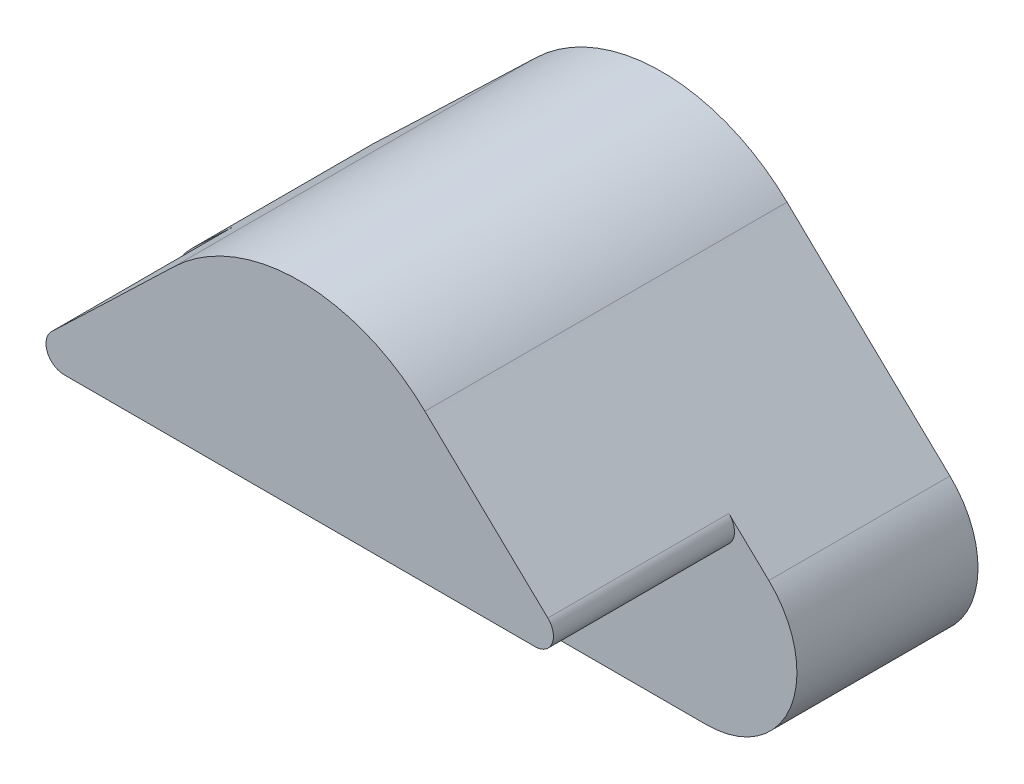
ISO-10303-21;
HEADER;
FILE_DESCRIPTION(('STEP AP214'),'2;1');
FILE_NAME('part.step','',(''),(''),'','','');
FILE_SCHEMA(('AUTOMOTIVE_DESIGN { 1 0 10303 214 1 1 1 1 }'));
ENDSEC;
DATA;
#1=APPLICATION_CONTEXT('core data for automotive mechanical design processes');
#2=APPLICATION_PROTOCOL_DEFINITION('international standard','automotive_design',2000,#1);
#3=PRODUCT_CONTEXT('',#1,'mechanical');
#4=PRODUCT('Part','Part','',(#3));
#5=PRODUCT_RELATED_PRODUCT_CATEGORY('part','',(#4));
#6=PRODUCT_DEFINITION_FORMATION('','',#4);
#7=PRODUCT_DEFINITION_CONTEXT('part definition',#1,'design');
#8=PRODUCT_DEFINITION('design','',#6,#7);
#9=PRODUCT_DEFINITION_SHAPE('','',#8);
#10=(LENGTH_UNIT() NAMED_UNIT(*) SI_UNIT(.MILLI.,.METRE.));
#11=(NAMED_UNIT(*) PLANE_ANGLE_UNIT() SI_UNIT($,.RADIAN.));
#12=(NAMED_UNIT(*) SI_UNIT($,.STERADIAN.) SOLID_ANGLE_UNIT());
#13=UNCERTAINTY_MEASURE_WITH_UNIT(LENGTH_MEASURE(1.E-05),#10,'distance_accuracy_value','');
#14=(GEOMETRIC_REPRESENTATION_CONTEXT(3) GLOBAL_UNCERTAINTY_ASSIGNED_CONTEXT((#13)) GLOBAL_UNIT_ASSIGNED_CONTEXT((#10,
#11,#12)) REPRESENTATION_CONTEXT('',''));
#15=CARTESIAN_POINT('',(0.,0.,0.));
#16=DIRECTION('',(0.,0.,1.));
#17=DIRECTION('',(1.,0.,0.));
#18=AXIS2_PLACEMENT_3D('',#15,#16,#17);
#19=CARTESIAN_POINT('',(-308.287195738068,327.322533480247,4.));
#20=DIRECTION('',(0.,0.,1.));
#21=DIRECTION('',(1.,0.,0.));
#22=AXIS2_PLACEMENT_3D('',#19,#20,#21);
#23=PLANE('',#22);
#24=CARTESIAN_POINT('',(-308.287195738068,327.322533480247,4.));
#25=DIRECTION('',(0.,0.,-1.));
#26=DIRECTION('',(1.,0.,0.));
#27=AXIS2_PLACEMENT_3D('',#24,#25,#26);
#28=CIRCLE('',#27,449.645455864917);
#29=CARTESIAN_POINT('',(3.61268527483216,3.44061023644068,4.));
#30=VERTEX_POINT('',#29);
#31=CARTESIAN_POINT('',(2.26130598674446,2.14463746570681,4.));
#32=VERTEX_POINT('',#31);
#33=EDGE_CURVE('E204',#30,#32,#28,.T.);
#34=ORIENTED_EDGE('',*,*,#33,.T.);
#35=CARTESIAN_POINT('',(2.3994363726626,2.,4.));
#36=DIRECTION('',(0.,0.,1.));
#37=DIRECTION('',(1.,0.,0.));
#38=AXIS2_PLACEMENT_3D('',#35,#36,#37);
#39=CIRCLE('',#38,0.2);
#40=CARTESIAN_POINT('',(2.3994363726626,1.8,4.));
#41=VERTEX_POINT('',#40);
#42=EDGE_CURVE('E248',#32,#41,#39,.T.);
#43=ORIENTED_EDGE('',*,*,#42,.T.);
#44=DIRECTION('',(-1.,0.,0.));
#45=VECTOR('',#44,1.);
#46=CARTESIAN_POINT('',(0.99783252754089,1.8,4.));
#47=LINE('',#46,#45);
#48=CARTESIAN_POINT('',(3.,1.8,4.));
#49=VERTEX_POINT('',#48);
#50=EDGE_CURVE('E155',#49,#41,#47,.T.);
#51=ORIENTED_EDGE('',*,*,#50,.F.);
#52=DIRECTION('',(-1.,0.,0.));
#53=VECTOR('',#52,1.);
#54=CARTESIAN_POINT('',(3.,1.8,4.));
#55=LINE('',#54,#53);
#56=CARTESIAN_POINT('',(7.,1.8,4.));
#57=VERTEX_POINT('',#56);
#58=EDGE_CURVE('E172',#57,#49,#55,.T.);
#59=ORIENTED_EDGE('',*,*,#58,.F.);
#60=CARTESIAN_POINT('',(7.60425222220773,1.8,4.));
#61=VERTEX_POINT('',#60);
#62=EDGE_CURVE('E144',#61,#57,#47,.T.);
#63=ORIENTED_EDGE('',*,*,#62,.F.);
#64=CARTESIAN_POINT('',(7.60425222220773,2.,4.));
#65=DIRECTION('',(0.,0.,1.));
#66=DIRECTION('',(1.,0.,0.));
#67=AXIS2_PLACEMENT_3D('',#64,#65,#66);
#68=CIRCLE('',#67,0.2);
#69=CARTESIAN_POINT('',(7.7423037942842,2.14471269276473,4.));
#70=VERTEX_POINT('',#69);
#71=EDGE_CURVE('E246',#61,#70,#68,.T.);
#72=ORIENTED_EDGE('',*,*,#71,.T.);
#73=CARTESIAN_POINT('',(518.159906987986,537.190454524297,4.));
#74=DIRECTION('',(0.,0.,-1.));
#75=DIRECTION('',(1.,0.,0.));
#76=AXIS2_PLACEMENT_3D('',#73,#74,#75);
#77=CIRCLE('',#76,739.459312945654);
#78=CARTESIAN_POINT('',(6.38418898523108,3.4436138171855,4.));
#79=VERTEX_POINT('',#78);
#80=EDGE_CURVE('E206',#70,#79,#77,.T.);
#81=ORIENTED_EDGE('',*,*,#80,.T.);
#82=CARTESIAN_POINT('',(5.,2.,4.));
#83=DIRECTION('',(0.,0.,1.));
#84=DIRECTION('',(1.,0.,0.));
#85=AXIS2_PLACEMENT_3D('',#82,#83,#84);
#86=CIRCLE('',#85,2.0000000000013);
#87=EDGE_CURVE('E209',#79,#30,#86,.T.);
#88=ORIENTED_EDGE('',*,*,#87,.T.);
#89=EDGE_LOOP('',(#34,#43,#51,#59,#63,#72,#81,#88));
#90=FACE_BOUND('',#89,.T.);
#91=ADVANCED_FACE('F41',(#90),#23,.T.);
#92=CARTESIAN_POINT('',(3.,1.,4.));
#93=DIRECTION('',(0.,-0.956304755963035,-0.292371704722737));
#94=DIRECTION('',(0.,0.292371704722737,-0.956304755963035));
#95=AXIS2_PLACEMENT_3D('',#92,#93,#94);
#96=PLANE('',#95);
#97=DIRECTION('',(-1.,0.,0.));
#98=VECTOR('',#97,1.);
#99=CARTESIAN_POINT('',(3.,1.61146136291732,2.));
#100=LINE('',#99,#98);
#101=CARTESIAN_POINT('',(6.85644894361678,1.61146136291732,2.));
#102=VERTEX_POINT('',#101);
#103=CARTESIAN_POINT('',(3.14355105638322,1.61146136291732,2.));
#104=VERTEX_POINT('',#103);
#105=EDGE_CURVE('E166',#102,#104,#100,.T.);
#106=ORIENTED_EDGE('',*,*,#105,.F.);
#107=DIRECTION('',(0.0684781562230237,-0.291685396047633,0.954059941435983));
#108=VECTOR('',#107,1.);
#109=CARTESIAN_POINT('',(6.98124296848118,1.0798963124741,3.73867093713687));
#110=LINE('',#109,#108);
#111=CARTESIAN_POINT('',(6.72025629578379,2.19157929559884,0.102519740859059));
#112=VERTEX_POINT('',#111);
#113=EDGE_CURVE('E176',#112,#102,#110,.T.);
#114=ORIENTED_EDGE('',*,*,#113,.F.);
#115=DIRECTION('',(1.,0.,0.));
#116=VECTOR('',#115,1.);
#117=CARTESIAN_POINT('',(3.,2.19157929559884,0.10251974085906));
#118=LINE('',#117,#116);
#119=CARTESIAN_POINT('',(3.27974370421621,2.19157929559884,0.102519740859059));
#120=VERTEX_POINT('',#119);
#121=EDGE_CURVE('E186',#120,#112,#118,.T.);
#122=ORIENTED_EDGE('',*,*,#121,.F.);
#123=DIRECTION('',(-0.0684781562230237,-0.291685396047633,0.954059941435983));
#124=VECTOR('',#123,1.);
#125=CARTESIAN_POINT('',(3.,1.,4.));
#126=LINE('',#125,#124);
#127=EDGE_CURVE('E195',#120,#104,#126,.T.);
#128=ORIENTED_EDGE('',*,*,#127,.T.);
#129=EDGE_LOOP('',(#106,#114,#122,#128));
#130=FACE_BOUND('',#129,.T.);
#131=ADVANCED_FACE('F310',(#130),#96,.F.);
#132=CARTESIAN_POINT('',(-308.287195738068,327.322533480247,4.));
#133=DIRECTION('',(0.,0.,-1.));
#134=DIRECTION('',(-1.,0.,0.));
#135=AXIS2_PLACEMENT_3D('',#132,#133,#134);
#136=CYLINDRICAL_SURFACE('',#135,449.645455864917);
#137=CARTESIAN_POINT('',(-308.287195738068,327.322533480247,2.));
#138=DIRECTION('',(0.,0.,1.));
#139=DIRECTION('',(1.,0.,0.));
#140=AXIS2_PLACEMENT_3D('',#137,#138,#139);
#141=CIRCLE('',#140,449.645455864917);
#142=CARTESIAN_POINT('',(2.26130598674446,2.14463746570681,2.));
#143=VERTEX_POINT('',#142);
#144=CARTESIAN_POINT('',(1.82038361963038,1.72412254297327,2.));
#145=VERTEX_POINT('',#144);
#146=EDGE_CURVE('E189',#143,#145,#141,.F.);
#147=ORIENTED_EDGE('',*,*,#146,.F.);
#148=DIRECTION('',(0.,0.,-1.));
#149=VECTOR('',#148,1.);
#150=CARTESIAN_POINT('',(2.26130598674451,2.14463746570681,4.));
#151=LINE('',#150,#149);
#152=EDGE_CURVE('E243',#143,#32,#151,.F.);
#153=ORIENTED_EDGE('',*,*,#152,.T.);
#154=ORIENTED_EDGE('',*,*,#33,.F.);
#155=DIRECTION('',(0.,0.,-1.));
#156=VECTOR('',#155,1.);
#157=CARTESIAN_POINT('',(3.61268527483216,3.44061023644068,4.));
#158=LINE('',#157,#156);
#159=CARTESIAN_POINT('',(3.61268527483216,3.44061023644068,0.));
#160=VERTEX_POINT('',#159);
#161=EDGE_CURVE('E211',#30,#160,#158,.T.);
#162=ORIENTED_EDGE('',*,*,#161,.T.);
#163=CARTESIAN_POINT('',(-308.287195738068,327.322533480247,0.));
#164=DIRECTION('',(0.,0.,-1.));
#165=DIRECTION('',(1.,0.,0.));
#166=AXIS2_PLACEMENT_3D('',#163,#164,#165);
#167=CIRCLE('',#166,449.645455864917);
#168=CARTESIAN_POINT('',(1.82038361963038,1.72412254297327,0.));
#169=VERTEX_POINT('',#168);
#170=EDGE_CURVE('E194',#160,#169,#167,.T.);
#171=ORIENTED_EDGE('',*,*,#170,.T.);
#172=DIRECTION('',(0.,0.,-1.));
#173=VECTOR('',#172,1.);
#174=CARTESIAN_POINT('',(1.82038361963038,1.72412254297322,4.));
#175=LINE('',#174,#173);
#176=EDGE_CURVE('E234',#169,#145,#175,.F.);
#177=ORIENTED_EDGE('',*,*,#176,.T.);
#178=EDGE_LOOP('',(#147,#153,#154,#162,#171,#177));
#179=FACE_BOUND('',#178,.T.);
#180=ADVANCED_FACE('F269',(#179),#136,.F.);
#181=CARTESIAN_POINT('',(0.,0.,4.));
#182=DIRECTION('',(0.,1.,0.));
#183=DIRECTION('',(0.,0.,1.));
#184=AXIS2_PLACEMENT_3D('',#181,#182,#183);
#185=PLANE('',#184);
#186=DIRECTION('',(1.,0.,0.));
#187=VECTOR('',#186,1.);
#188=CARTESIAN_POINT('',(0.99783252754089,0.,2.));
#189=LINE('',#188,#187);
#190=CARTESIAN_POINT('',(2.51005494914752,0.,2.));
#191=VERTEX_POINT('',#190);
#192=CARTESIAN_POINT('',(7.49388050396682,0.,2.));
#193=VERTEX_POINT('',#192);
#194=EDGE_CURVE('E154',#191,#193,#189,.T.);
#195=ORIENTED_EDGE('',*,*,#194,.F.);
#196=DIRECTION('',(0.,0.,-1.));
#197=VECTOR('',#196,1.);
#198=CARTESIAN_POINT('',(2.51005494914752,0.,4.));
#199=LINE('',#198,#197);
#200=CARTESIAN_POINT('',(2.51005494914752,0.,0.));
#201=VERTEX_POINT('',#200);
#202=EDGE_CURVE('E227',#191,#201,#199,.T.);
#203=ORIENTED_EDGE('',*,*,#202,.T.);
#204=DIRECTION('',(1.,0.,0.));
#205=VECTOR('',#204,1.);
#206=CARTESIAN_POINT('',(0.,0.,0.));
#207=LINE('',#206,#205);
#208=CARTESIAN_POINT('',(7.49388050396682,0.,0.));
#209=VERTEX_POINT('',#208);
#210=EDGE_CURVE('E214',#201,#209,#207,.T.);
#211=ORIENTED_EDGE('',*,*,#210,.T.);
#212=DIRECTION('',(0.,0.,-1.));
#213=VECTOR('',#212,1.);
#214=CARTESIAN_POINT('',(7.49388050396682,0.,4.));
#215=LINE('',#214,#213);
#216=EDGE_CURVE('E165',#209,#193,#215,.F.);
#217=ORIENTED_EDGE('',*,*,#216,.T.);
#218=EDGE_LOOP('',(#195,#203,#211,#217));
#219=FACE_BOUND('',#218,.T.);
#220=ADVANCED_FACE('F288',(#219),#185,.F.);
#221=CARTESIAN_POINT('',(518.159906987986,537.190454524297,4.));
#222=DIRECTION('',(0.,0.,-1.));
#223=DIRECTION('',(-1.,0.,0.));
#224=AXIS2_PLACEMENT_3D('',#221,#222,#223);
#225=CYLINDRICAL_SURFACE('',#224,739.459312945654);
#226=ORIENTED_EDGE('',*,*,#80,.F.);
#227=DIRECTION('',(0.,0.,-1.));
#228=VECTOR('',#227,1.);
#229=CARTESIAN_POINT('',(7.7423037942842,2.14471269276473,4.));
#230=LINE('',#229,#228);
#231=CARTESIAN_POINT('',(7.7423037942842,2.14471269276473,2.));
#232=VERTEX_POINT('',#231);
#233=EDGE_CURVE('E252',#70,#232,#230,.T.);
#234=ORIENTED_EDGE('',*,*,#233,.T.);
#235=CARTESIAN_POINT('',(518.159906987986,537.190454524297,2.));
#236=DIRECTION('',(0.,0.,1.));
#237=DIRECTION('',(1.,0.,0.));
#238=AXIS2_PLACEMENT_3D('',#235,#236,#237);
#239=CIRCLE('',#238,739.459312945654);
#240=CARTESIAN_POINT('',(8.18354166097557,1.72413223137302,2.));
#241=VERTEX_POINT('',#240);
#242=EDGE_CURVE('E59',#241,#232,#239,.F.);
#243=ORIENTED_EDGE('',*,*,#242,.F.);
#244=DIRECTION('',(0.,0.,-1.));
#245=VECTOR('',#244,1.);
#246=CARTESIAN_POINT('',(8.18354166097557,1.72413223137302,4.));
#247=LINE('',#246,#245);
#248=CARTESIAN_POINT('',(8.18354166097557,1.72413223137302,0.));
#249=VERTEX_POINT('',#248);
#250=EDGE_CURVE('E240',#241,#249,#247,.T.);
#251=ORIENTED_EDGE('',*,*,#250,.T.);
#252=CARTESIAN_POINT('',(518.159906987986,537.190454524297,0.));
#253=DIRECTION('',(0.,0.,-1.));
#254=DIRECTION('',(1.,0.,0.));
#255=AXIS2_PLACEMENT_3D('',#252,#253,#254);
#256=CIRCLE('',#255,739.459312945654);
#257=CARTESIAN_POINT('',(6.38418898523108,3.4436138171855,0.));
#258=VERTEX_POINT('',#257);
#259=EDGE_CURVE('E217',#249,#258,#256,.T.);
#260=ORIENTED_EDGE('',*,*,#259,.T.);
#261=DIRECTION('',(0.,0.,-1.));
#262=VECTOR('',#261,1.);
#263=CARTESIAN_POINT('',(6.38418898523108,3.4436138171855,4.));
#264=LINE('',#263,#262);
#265=EDGE_CURVE('E222',#79,#258,#264,.T.);
#266=ORIENTED_EDGE('',*,*,#265,.F.);
#267=EDGE_LOOP('',(#226,#234,#243,#251,#260,#266));
#268=FACE_BOUND('',#267,.T.);
#269=ADVANCED_FACE('F332',(#268),#225,.F.);
#270=CARTESIAN_POINT('',(5.,2.,4.));
#271=DIRECTION('',(0.,0.,-1.));
#272=DIRECTION('',(-1.,0.,0.));
#273=AXIS2_PLACEMENT_3D('',#270,#271,#272);
#274=CYLINDRICAL_SURFACE('',#273,2.0000000000013);
#275=CARTESIAN_POINT('',(5.,2.,0.));
#276=DIRECTION('',(0.,0.,1.));
#277=DIRECTION('',(1.,0.,0.));
#278=AXIS2_PLACEMENT_3D('',#275,#276,#277);
#279=CIRCLE('',#278,2.0000000000013);
#280=EDGE_CURVE('E207',#258,#160,#279,.T.);
#281=ORIENTED_EDGE('',*,*,#280,.T.);
#282=ORIENTED_EDGE('',*,*,#161,.F.);
#283=ORIENTED_EDGE('',*,*,#87,.F.);
#284=ORIENTED_EDGE('',*,*,#265,.T.);
#285=EDGE_LOOP('',(#281,#282,#283,#284));
#286=FACE_BOUND('',#285,.T.);
#287=ADVANCED_FACE('F275',(#286),#274,.T.);
#288=CARTESIAN_POINT('',(-308.287195738068,327.322533480247,0.));
#289=DIRECTION('',(0.,0.,1.));
#290=DIRECTION('',(1.,0.,0.));
#291=AXIS2_PLACEMENT_3D('',#288,#289,#290);
#292=PLANE('',#291);
#293=ORIENTED_EDGE('',*,*,#210,.F.);
#294=CARTESIAN_POINT('',(2.51005494914752,1.,0.));
#295=DIRECTION('',(0.,0.,1.));
#296=DIRECTION('',(1.,0.,0.));
#297=AXIS2_PLACEMENT_3D('',#294,#295,#296);
#298=CIRCLE('',#297,1.);
#299=EDGE_CURVE('E232',#201,#169,#298,.F.);
#300=ORIENTED_EDGE('',*,*,#299,.T.);
#301=ORIENTED_EDGE('',*,*,#170,.F.);
#302=ORIENTED_EDGE('',*,*,#280,.F.);
#303=ORIENTED_EDGE('',*,*,#259,.F.);
#304=CARTESIAN_POINT('',(7.49388050396682,1.,0.));
#305=DIRECTION('',(0.,0.,1.));
#306=DIRECTION('',(1.,0.,0.));
#307=AXIS2_PLACEMENT_3D('',#304,#305,#306);
#308=CIRCLE('',#307,1.);
#309=EDGE_CURVE('E230',#249,#209,#308,.F.);
#310=ORIENTED_EDGE('',*,*,#309,.T.);
#311=EDGE_LOOP('',(#293,#300,#301,#302,#303,#310));
#312=FACE_BOUND('',#311,.T.);
#313=ADVANCED_FACE('F281',(#312),#292,.F.);
#314=CARTESIAN_POINT('',(3.,1.,4.));
#315=DIRECTION('',(-0.997434046847554,0.,-0.0715913555487778));
#316=DIRECTION('',(-0.0715913555487778,0.,0.997434046847554));
#317=AXIS2_PLACEMENT_3D('',#314,#315,#316);
#318=PLANE('',#317);
#319=DIRECTION('',(-0.0707143819975287,-0.156042847719278,0.985215766141796));
#320=VECTOR('',#319,1.);
#321=CARTESIAN_POINT('',(3.,1.8,4.));
#322=LINE('',#321,#320);
#323=CARTESIAN_POINT('',(3.27974370421621,2.41730022951997,0.102519740859059));
#324=VERTEX_POINT('',#323);
#325=EDGE_CURVE('E175',#324,#49,#322,.T.);
#326=ORIENTED_EDGE('',*,*,#325,.T.);
#327=DIRECTION('',(0.0715913555487778,0.,-0.997434046847554));
#328=VECTOR('',#327,1.);
#329=CARTESIAN_POINT('',(3.,1.8,4.));
#330=LINE('',#329,#328);
#331=CARTESIAN_POINT('',(3.14355105638322,1.8,2.));
#332=VERTEX_POINT('',#331);
#333=EDGE_CURVE('E183',#49,#332,#330,.T.);
#334=ORIENTED_EDGE('',*,*,#333,.T.);
#335=DIRECTION('',(0.,1.,0.));
#336=VECTOR('',#335,1.);
#337=CARTESIAN_POINT('',(3.14355105638322,1.,2.));
#338=LINE('',#337,#336);
#339=EDGE_CURVE('E297',#104,#332,#338,.T.);
#340=ORIENTED_EDGE('',*,*,#339,.F.);
#341=ORIENTED_EDGE('',*,*,#127,.F.);
#342=DIRECTION('',(0.,-1.,0.));
#343=VECTOR('',#342,1.);
#344=CARTESIAN_POINT('',(3.27974370421621,1.,0.102519740859059));
#345=LINE('',#344,#343);
#346=EDGE_CURVE('E182',#324,#120,#345,.T.);
#347=ORIENTED_EDGE('',*,*,#346,.F.);
#348=EDGE_LOOP('',(#326,#334,#340,#341,#347));
#349=FACE_BOUND('',#348,.T.);
#350=ADVANCED_FACE('F304',(#349),#318,.F.);
#351=CARTESIAN_POINT('',(3.,1.8,4.));
#352=DIRECTION('',(0.,0.987688340595138,0.156434465040231));
#353=DIRECTION('',(0.,-0.156434465040231,0.987688340595138));
#354=AXIS2_PLACEMENT_3D('',#351,#352,#353);
#355=PLANE('',#354);
#356=ORIENTED_EDGE('',*,*,#58,.T.);
#357=ORIENTED_EDGE('',*,*,#325,.F.);
#358=DIRECTION('',(-1.,0.,0.));
#359=VECTOR('',#358,1.);
#360=CARTESIAN_POINT('',(3.,2.41730022951997,0.102519740859059));
#361=LINE('',#360,#359);
#362=CARTESIAN_POINT('',(6.72025629578379,2.41730022951997,0.102519740859059));
#363=VERTEX_POINT('',#362);
#364=EDGE_CURVE('E174',#363,#324,#361,.T.);
#365=ORIENTED_EDGE('',*,*,#364,.F.);
#366=DIRECTION('',(0.0707143819975287,-0.156042847719278,0.985215766141796));
#367=VECTOR('',#366,1.);
#368=CARTESIAN_POINT('',(7.00882757883328,1.78052050374053,4.12298869901336));
#369=LINE('',#368,#367);
#370=EDGE_CURVE('E161',#363,#57,#369,.T.);
#371=ORIENTED_EDGE('',*,*,#370,.T.);
#372=EDGE_LOOP('',(#356,#357,#365,#371));
#373=FACE_BOUND('',#372,.T.);
#374=ADVANCED_FACE('F171',(#373),#355,.F.);
#375=CARTESIAN_POINT('',(7.,1.,4.));
#376=DIRECTION('',(0.997434046847554,0.,-0.0715913555487778));
#377=DIRECTION('',(-0.0715913555487778,0.,-0.997434046847554));
#378=AXIS2_PLACEMENT_3D('',#375,#376,#377);
#379=PLANE('',#378);
#380=DIRECTION('',(0.,-1.,0.));
#381=VECTOR('',#380,1.);
#382=CARTESIAN_POINT('',(6.85644894361678,1.,2.));
#383=LINE('',#382,#381);
#384=CARTESIAN_POINT('',(6.85644894361678,1.8,2.));
#385=VERTEX_POINT('',#384);
#386=EDGE_CURVE('E164',#385,#102,#383,.T.);
#387=ORIENTED_EDGE('',*,*,#386,.F.);
#388=DIRECTION('',(0.0715913555487778,0.,0.997434046847554));
#389=VECTOR('',#388,1.);
#390=CARTESIAN_POINT('',(7.,1.8,4.));
#391=LINE('',#390,#389);
#392=EDGE_CURVE('E147',#385,#57,#391,.T.);
#393=ORIENTED_EDGE('',*,*,#392,.T.);
#394=ORIENTED_EDGE('',*,*,#370,.F.);
#395=DIRECTION('',(0.,1.,0.));
#396=VECTOR('',#395,1.);
#397=CARTESIAN_POINT('',(6.72025629578379,1.,0.102519740859059));
#398=LINE('',#397,#396);
#399=EDGE_CURVE('E200',#112,#363,#398,.T.);
#400=ORIENTED_EDGE('',*,*,#399,.F.);
#401=ORIENTED_EDGE('',*,*,#113,.T.);
#402=EDGE_LOOP('',(#387,#393,#394,#400,#401));
#403=FACE_BOUND('',#402,.T.);
#404=ADVANCED_FACE('F159',(#403),#379,.F.);
#405=CARTESIAN_POINT('',(0.,0.899804217375462,0.102519740859059));
#406=DIRECTION('',(0.,0.,-1.));
#407=DIRECTION('',(-1.,0.,0.));
#408=AXIS2_PLACEMENT_3D('',#405,#406,#407);
#409=PLANE('',#408);
#410=ORIENTED_EDGE('',*,*,#346,.T.);
#411=ORIENTED_EDGE('',*,*,#121,.T.);
#412=ORIENTED_EDGE('',*,*,#399,.T.);
#413=ORIENTED_EDGE('',*,*,#364,.T.);
#414=EDGE_LOOP('',(#410,#411,#412,#413));
#415=FACE_BOUND('',#414,.T.);
#416=ADVANCED_FACE('F308',(#415),#409,.F.);
#417=CARTESIAN_POINT('',(0.99783252754089,1.8,2.));
#418=DIRECTION('',(0.,1.,0.));
#419=DIRECTION('',(0.,0.,1.));
#420=AXIS2_PLACEMENT_3D('',#417,#418,#419);
#421=PLANE('',#420);
#422=ORIENTED_EDGE('',*,*,#50,.T.);
#423=DIRECTION('',(0.,0.,-1.));
#424=VECTOR('',#423,1.);
#425=CARTESIAN_POINT('',(2.3994363726626,1.8,2.));
#426=LINE('',#425,#424);
#427=CARTESIAN_POINT('',(2.3994363726626,1.8,2.));
#428=VERTEX_POINT('',#427);
#429=EDGE_CURVE('E250',#41,#428,#426,.T.);
#430=ORIENTED_EDGE('',*,*,#429,.T.);
#431=DIRECTION('',(-1.,0.,0.));
#432=VECTOR('',#431,1.);
#433=CARTESIAN_POINT('',(0.99783252754089,1.8,2.));
#434=LINE('',#433,#432);
#435=EDGE_CURVE('E263',#332,#428,#434,.T.);
#436=ORIENTED_EDGE('',*,*,#435,.F.);
#437=ORIENTED_EDGE('',*,*,#333,.F.);
#438=EDGE_LOOP('',(#422,#430,#436,#437));
#439=FACE_BOUND('',#438,.T.);
#440=ADVANCED_FACE('F303',(#439),#421,.F.);
#441=CARTESIAN_POINT('',(7.60425222220773,1.8,2.));
#442=VERTEX_POINT('',#441);
#443=EDGE_CURVE('E293',#442,#385,#434,.T.);
#444=ORIENTED_EDGE('',*,*,#443,.F.);
#445=DIRECTION('',(0.,0.,-1.));
#446=VECTOR('',#445,1.);
#447=CARTESIAN_POINT('',(7.60425222220773,1.8,2.));
#448=LINE('',#447,#446);
#449=EDGE_CURVE('E150',#442,#61,#448,.F.);
#450=ORIENTED_EDGE('',*,*,#449,.T.);
#451=ORIENTED_EDGE('',*,*,#62,.T.);
#452=ORIENTED_EDGE('',*,*,#392,.F.);
#453=EDGE_LOOP('',(#444,#450,#451,#452));
#454=FACE_BOUND('',#453,.T.);
#455=ADVANCED_FACE('F146',(#454),#421,.F.);
#456=CARTESIAN_POINT('',(0.,0.,2.));
#457=DIRECTION('',(0.,0.,1.));
#458=DIRECTION('',(1.,0.,0.));
#459=AXIS2_PLACEMENT_3D('',#456,#457,#458);
#460=PLANE('',#459);
#461=ORIENTED_EDGE('',*,*,#146,.T.);
#462=CARTESIAN_POINT('',(2.51005494914752,1.,2.));
#463=DIRECTION('',(0.,0.,1.));
#464=DIRECTION('',(1.,0.,0.));
#465=AXIS2_PLACEMENT_3D('',#462,#463,#464);
#466=CIRCLE('',#465,1.);
#467=EDGE_CURVE('E238',#145,#191,#466,.T.);
#468=ORIENTED_EDGE('',*,*,#467,.T.);
#469=ORIENTED_EDGE('',*,*,#194,.T.);
#470=CARTESIAN_POINT('',(7.49388050396682,1.,2.));
#471=DIRECTION('',(0.,0.,1.));
#472=DIRECTION('',(1.,0.,0.));
#473=AXIS2_PLACEMENT_3D('',#470,#471,#472);
#474=CIRCLE('',#473,1.);
#475=EDGE_CURVE('E236',#193,#241,#474,.T.);
#476=ORIENTED_EDGE('',*,*,#475,.T.);
#477=ORIENTED_EDGE('',*,*,#242,.T.);
#478=CARTESIAN_POINT('',(7.60425222220773,2.,2.));
#479=DIRECTION('',(0.,0.,1.));
#480=DIRECTION('',(1.,0.,0.));
#481=AXIS2_PLACEMENT_3D('',#478,#479,#480);
#482=CIRCLE('',#481,0.2);
#483=EDGE_CURVE('E11',#232,#442,#482,.F.);
#484=ORIENTED_EDGE('',*,*,#483,.T.);
#485=ORIENTED_EDGE('',*,*,#443,.T.);
#486=ORIENTED_EDGE('',*,*,#386,.T.);
#487=ORIENTED_EDGE('',*,*,#105,.T.);
#488=ORIENTED_EDGE('',*,*,#339,.T.);
#489=ORIENTED_EDGE('',*,*,#435,.T.);
#490=CARTESIAN_POINT('',(2.3994363726626,2.,2.));
#491=DIRECTION('',(0.,0.,1.));
#492=DIRECTION('',(1.,0.,0.));
#493=AXIS2_PLACEMENT_3D('',#490,#491,#492);
#494=CIRCLE('',#493,0.2);
#495=EDGE_CURVE('E49',#428,#143,#494,.F.);
#496=ORIENTED_EDGE('',*,*,#495,.T.);
#497=EDGE_LOOP('',(#461,#468,#469,#476,#477,#484,#485,#486,#487,#488,#489,#496));
#498=FACE_BOUND('',#497,.T.);
#499=ADVANCED_FACE('F260',(#498),#460,.T.);
#500=CARTESIAN_POINT('',(2.51005494914752,1.,4.));
#501=DIRECTION('',(0.,0.,-1.));
#502=DIRECTION('',(-1.,0.,0.));
#503=AXIS2_PLACEMENT_3D('',#500,#501,#502);
#504=CYLINDRICAL_SURFACE('',#503,1.);
#505=ORIENTED_EDGE('',*,*,#467,.F.);
#506=ORIENTED_EDGE('',*,*,#176,.F.);
#507=ORIENTED_EDGE('',*,*,#299,.F.);
#508=ORIENTED_EDGE('',*,*,#202,.F.);
#509=EDGE_LOOP('',(#505,#506,#507,#508));
#510=FACE_BOUND('',#509,.T.);
#511=ADVANCED_FACE('F285',(#510),#504,.T.);
#512=CARTESIAN_POINT('',(7.49388050396682,1.,4.));
#513=DIRECTION('',(0.,0.,-1.));
#514=DIRECTION('',(-1.,0.,0.));
#515=AXIS2_PLACEMENT_3D('',#512,#513,#514);
#516=CYLINDRICAL_SURFACE('',#515,1.);
#517=ORIENTED_EDGE('',*,*,#475,.F.);
#518=ORIENTED_EDGE('',*,*,#216,.F.);
#519=ORIENTED_EDGE('',*,*,#309,.F.);
#520=ORIENTED_EDGE('',*,*,#250,.F.);
#521=EDGE_LOOP('',(#517,#518,#519,#520));
#522=FACE_BOUND('',#521,.T.);
#523=ADVANCED_FACE('F340',(#522),#516,.T.);
#524=CARTESIAN_POINT('',(2.3994363726626,2.,4.));
#525=DIRECTION('',(0.,0.,-1.));
#526=DIRECTION('',(-1.,0.,0.));
#527=AXIS2_PLACEMENT_3D('',#524,#525,#526);
#528=CYLINDRICAL_SURFACE('',#527,0.2);
#529=ORIENTED_EDGE('',*,*,#495,.F.);
#530=ORIENTED_EDGE('',*,*,#429,.F.);
#531=ORIENTED_EDGE('',*,*,#42,.F.);
#532=ORIENTED_EDGE('',*,*,#152,.F.);
#533=EDGE_LOOP('',(#529,#530,#531,#532));
#534=FACE_BOUND('',#533,.T.);
#535=ADVANCED_FACE('F266',(#534),#528,.T.);
#536=CARTESIAN_POINT('',(7.60425222220773,2.,4.));
#537=DIRECTION('',(0.,0.,-1.));
#538=DIRECTION('',(-1.,0.,0.));
#539=AXIS2_PLACEMENT_3D('',#536,#537,#538);
#540=CYLINDRICAL_SURFACE('',#539,0.2);
#541=ORIENTED_EDGE('',*,*,#71,.F.);
#542=ORIENTED_EDGE('',*,*,#449,.F.);
#543=ORIENTED_EDGE('',*,*,#483,.F.);
#544=ORIENTED_EDGE('',*,*,#233,.F.);
#545=EDGE_LOOP('',(#541,#542,#543,#544));
#546=FACE_BOUND('',#545,.T.);
#547=ADVANCED_FACE('F43',(#546),#540,.T.);
#548=CLOSED_SHELL('',(#91,#131,#180,#220,#269,#287,#313,#350,#374,#404,#416,#440,#455,#499,#511,
#523,#535,#547));
#549=MANIFOLD_SOLID_BREP('B2',#548);
#550=ADVANCED_BREP_SHAPE_REPRESENTATION('',(#18,#549),#14);
#551=SHAPE_DEFINITION_REPRESENTATION(#9,#550);
ENDSEC;
END-ISO-10303-21;
